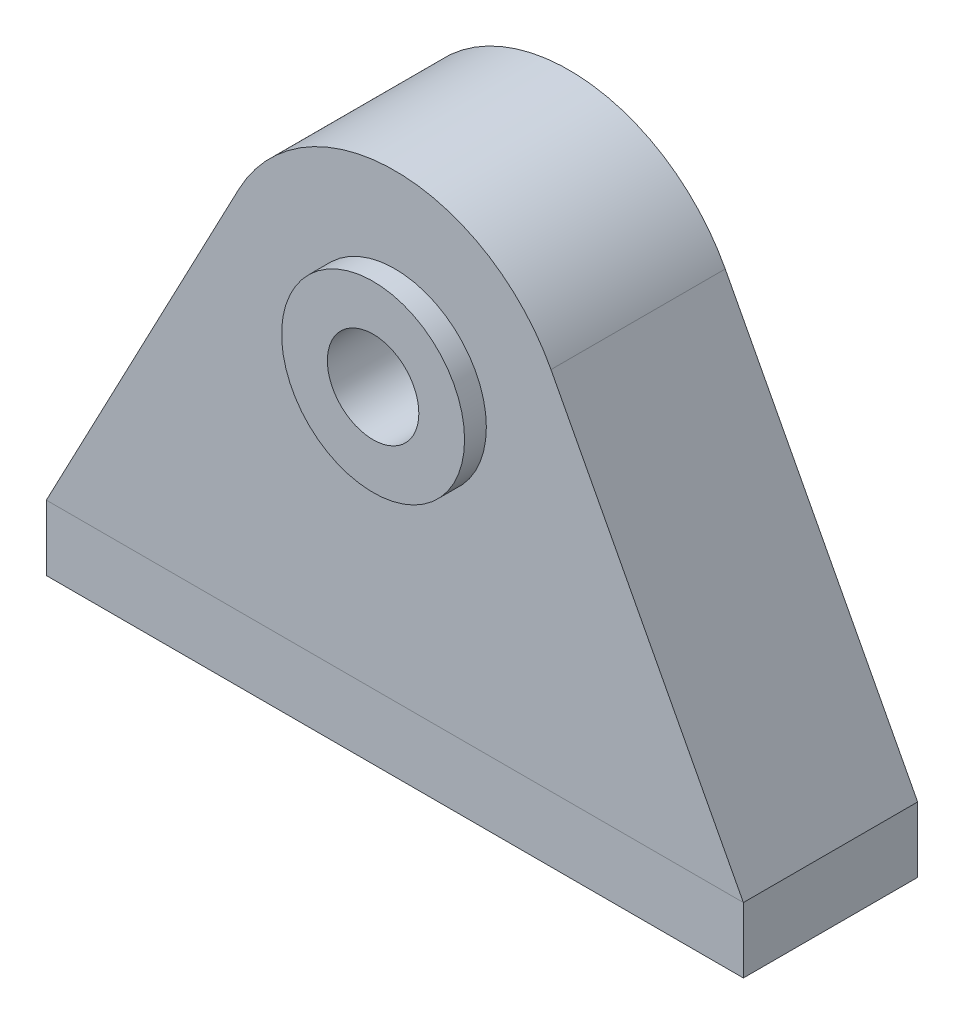
ISO-10303-21;
HEADER;
FILE_DESCRIPTION(('STEP AP214'),'2;1');
FILE_NAME('part.step','',(''),(''),'','','');
FILE_SCHEMA(('AUTOMOTIVE_DESIGN { 1 0 10303 214 1 1 1 1 }'));
ENDSEC;
DATA;
#1=APPLICATION_CONTEXT('core data for automotive mechanical design processes');
#2=APPLICATION_PROTOCOL_DEFINITION('international standard','automotive_design',2000,#1);
#3=PRODUCT_CONTEXT('',#1,'mechanical');
#4=PRODUCT('Part','Part','',(#3));
#5=PRODUCT_RELATED_PRODUCT_CATEGORY('part','',(#4));
#6=PRODUCT_DEFINITION_FORMATION('','',#4);
#7=PRODUCT_DEFINITION_CONTEXT('part definition',#1,'design');
#8=PRODUCT_DEFINITION('design','',#6,#7);
#9=PRODUCT_DEFINITION_SHAPE('','',#8);
#10=(LENGTH_UNIT() NAMED_UNIT(*) SI_UNIT(.MILLI.,.METRE.));
#11=(NAMED_UNIT(*) PLANE_ANGLE_UNIT() SI_UNIT($,.RADIAN.));
#12=(NAMED_UNIT(*) SI_UNIT($,.STERADIAN.) SOLID_ANGLE_UNIT());
#13=UNCERTAINTY_MEASURE_WITH_UNIT(LENGTH_MEASURE(1.E-05),#10,'distance_accuracy_value','');
#14=(GEOMETRIC_REPRESENTATION_CONTEXT(3) GLOBAL_UNCERTAINTY_ASSIGNED_CONTEXT((#13)) GLOBAL_UNIT_ASSIGNED_CONTEXT((#10,
#11,#12)) REPRESENTATION_CONTEXT('',''));
#15=CARTESIAN_POINT('',(0.,0.,0.));
#16=DIRECTION('',(0.,0.,1.));
#17=DIRECTION('',(1.,0.,0.));
#18=AXIS2_PLACEMENT_3D('',#15,#16,#17);
#19=CARTESIAN_POINT('',(0.,0.,-25.4));
#20=DIRECTION('',(0.,0.,1.));
#21=DIRECTION('',(1.,0.,0.));
#22=AXIS2_PLACEMENT_3D('',#19,#20,#21);
#23=PLANE('',#22);
#24=DIRECTION('',(-1.,0.,0.));
#25=VECTOR('',#24,1.);
#26=CARTESIAN_POINT('',(0.,19.05,-25.4));
#27=LINE('',#26,#25);
#28=CARTESIAN_POINT('',(101.6,19.05,-25.4));
#29=VERTEX_POINT('',#28);
#30=CARTESIAN_POINT('',(-101.6,19.05,-25.4));
#31=VERTEX_POINT('',#30);
#32=EDGE_CURVE('E54',#29,#31,#27,.T.);
#33=ORIENTED_EDGE('',*,*,#32,.F.);
#34=DIRECTION('',(0.,1.,0.));
#35=VECTOR('',#34,1.);
#36=CARTESIAN_POINT('',(101.6,0.,-25.4));
#37=LINE('',#36,#35);
#38=CARTESIAN_POINT('',(101.6,0.,-25.4));
#39=VERTEX_POINT('',#38);
#40=EDGE_CURVE('E146',#39,#29,#37,.T.);
#41=ORIENTED_EDGE('',*,*,#40,.F.);
#42=DIRECTION('',(1.,0.,0.));
#43=VECTOR('',#42,1.);
#44=CARTESIAN_POINT('',(0.,0.,-25.4));
#45=LINE('',#44,#43);
#46=CARTESIAN_POINT('',(-101.6,0.,-25.4));
#47=VERTEX_POINT('',#46);
#48=EDGE_CURVE('E85',#47,#39,#45,.T.);
#49=ORIENTED_EDGE('',*,*,#48,.F.);
#50=DIRECTION('',(0.,1.,0.));
#51=VECTOR('',#50,1.);
#52=CARTESIAN_POINT('',(-101.6,0.,-25.4));
#53=LINE('',#52,#51);
#54=EDGE_CURVE('E114',#47,#31,#53,.T.);
#55=ORIENTED_EDGE('',*,*,#54,.T.);
#56=EDGE_LOOP('',(#33,#41,#49,#55));
#57=FACE_BOUND('',#56,.T.);
#58=ADVANCED_FACE('F45',(#57),#23,.F.);
#59=CARTESIAN_POINT('',(0.,0.,25.4));
#60=DIRECTION('',(0.,0.,1.));
#61=DIRECTION('',(1.,0.,0.));
#62=AXIS2_PLACEMENT_3D('',#59,#60,#61);
#63=PLANE('',#62);
#64=DIRECTION('',(0.,1.,0.));
#65=VECTOR('',#64,1.);
#66=CARTESIAN_POINT('',(101.6,0.,25.4));
#67=LINE('',#66,#65);
#68=CARTESIAN_POINT('',(101.6,0.,25.4));
#69=VERTEX_POINT('',#68);
#70=CARTESIAN_POINT('',(101.6,19.05,25.4));
#71=VERTEX_POINT('',#70);
#72=EDGE_CURVE('E122',#69,#71,#67,.T.);
#73=ORIENTED_EDGE('',*,*,#72,.T.);
#74=DIRECTION('',(-1.,0.,0.));
#75=VECTOR('',#74,1.);
#76=CARTESIAN_POINT('',(0.,19.05,25.4));
#77=LINE('',#76,#75);
#78=CARTESIAN_POINT('',(-101.6,19.05,25.4));
#79=VERTEX_POINT('',#78);
#80=EDGE_CURVE('E62',#71,#79,#77,.T.);
#81=ORIENTED_EDGE('',*,*,#80,.T.);
#82=DIRECTION('',(0.,1.,0.));
#83=VECTOR('',#82,1.);
#84=CARTESIAN_POINT('',(-101.6,0.,25.4));
#85=LINE('',#84,#83);
#86=CARTESIAN_POINT('',(-101.6,0.,25.4));
#87=VERTEX_POINT('',#86);
#88=EDGE_CURVE('E113',#87,#79,#85,.T.);
#89=ORIENTED_EDGE('',*,*,#88,.F.);
#90=DIRECTION('',(1.,0.,0.));
#91=VECTOR('',#90,1.);
#92=CARTESIAN_POINT('',(0.,0.,25.4));
#93=LINE('',#92,#91);
#94=EDGE_CURVE('E118',#87,#69,#93,.T.);
#95=ORIENTED_EDGE('',*,*,#94,.T.);
#96=EDGE_LOOP('',(#73,#81,#89,#95));
#97=FACE_BOUND('',#96,.T.);
#98=ADVANCED_FACE('F124',(#97),#63,.T.);
#99=CARTESIAN_POINT('',(87.397011941816,46.0219086626603,25.4));
#100=DIRECTION('',(-0.884820223636944,-0.465932582937777,0.));
#101=DIRECTION('',(0.465932582937777,-0.884820223636944,0.));
#102=AXIS2_PLACEMENT_3D('',#99,#100,#101);
#103=PLANE('',#102);
#104=DIRECTION('',(-0.465932582937777,0.884820223636944,0.));
#105=VECTOR('',#104,1.);
#106=CARTESIAN_POINT('',(87.397011941816,46.0219086626603,-25.4));
#107=LINE('',#106,#105);
#108=CARTESIAN_POINT('',(45.5107282027662,125.565242403405,-25.4));
#109=VERTEX_POINT('',#108);
#110=EDGE_CURVE('E134',#29,#109,#107,.T.);
#111=ORIENTED_EDGE('',*,*,#110,.T.);
#112=DIRECTION('',(0.,0.,-1.));
#113=VECTOR('',#112,1.);
#114=CARTESIAN_POINT('',(45.5107282027662,125.565242403405,25.4));
#115=LINE('',#114,#113);
#116=CARTESIAN_POINT('',(45.5107282027662,125.565242403405,25.4));
#117=VERTEX_POINT('',#116);
#118=EDGE_CURVE('E155',#117,#109,#115,.T.);
#119=ORIENTED_EDGE('',*,*,#118,.F.);
#120=DIRECTION('',(-0.465932582937777,0.884820223636944,0.));
#121=VECTOR('',#120,1.);
#122=CARTESIAN_POINT('',(87.397011941816,46.0219086626603,25.4));
#123=LINE('',#122,#121);
#124=EDGE_CURVE('E148',#71,#117,#123,.T.);
#125=ORIENTED_EDGE('',*,*,#124,.F.);
#126=DIRECTION('',(0.,0.,-1.));
#127=VECTOR('',#126,1.);
#128=CARTESIAN_POINT('',(101.6,19.05,25.4));
#129=LINE('',#128,#127);
#130=EDGE_CURVE('E133',#71,#29,#129,.T.);
#131=ORIENTED_EDGE('',*,*,#130,.T.);
#132=EDGE_LOOP('',(#111,#119,#125,#131));
#133=FACE_BOUND('',#132,.T.);
#134=ADVANCED_FACE('F47',(#133),#103,.F.);
#135=CARTESIAN_POINT('',(0.,101.6,25.4));
#136=DIRECTION('',(0.,0.,-1.));
#137=DIRECTION('',(-1.,0.,0.));
#138=AXIS2_PLACEMENT_3D('',#135,#136,#137);
#139=CYLINDRICAL_SURFACE('',#138,51.435);
#140=CARTESIAN_POINT('',(0.,101.6,-25.4));
#141=DIRECTION('',(0.,0.,1.));
#142=DIRECTION('',(1.,0.,0.));
#143=AXIS2_PLACEMENT_3D('',#140,#141,#142);
#144=CIRCLE('',#143,51.435);
#145=CARTESIAN_POINT('',(-45.5107282027662,125.565242403405,-25.4));
#146=VERTEX_POINT('',#145);
#147=EDGE_CURVE('E136',#109,#146,#144,.T.);
#148=ORIENTED_EDGE('',*,*,#147,.T.);
#149=DIRECTION('',(0.,0.,-1.));
#150=VECTOR('',#149,1.);
#151=CARTESIAN_POINT('',(-45.5107282027662,125.565242403405,25.4));
#152=LINE('',#151,#150);
#153=CARTESIAN_POINT('',(-45.5107282027662,125.565242403405,25.4));
#154=VERTEX_POINT('',#153);
#155=EDGE_CURVE('E153',#154,#146,#152,.T.);
#156=ORIENTED_EDGE('',*,*,#155,.F.);
#157=CARTESIAN_POINT('',(0.,101.6,25.4));
#158=DIRECTION('',(0.,0.,1.));
#159=DIRECTION('',(1.,0.,0.));
#160=AXIS2_PLACEMENT_3D('',#157,#158,#159);
#161=CIRCLE('',#160,51.435);
#162=EDGE_CURVE('E100',#117,#154,#161,.T.);
#163=ORIENTED_EDGE('',*,*,#162,.F.);
#164=ORIENTED_EDGE('',*,*,#118,.T.);
#165=EDGE_LOOP('',(#148,#156,#163,#164));
#166=FACE_BOUND('',#165,.T.);
#167=ADVANCED_FACE('F240',(#166),#139,.T.);
#168=CARTESIAN_POINT('',(-87.397011941816,46.0219086626603,25.4));
#169=DIRECTION('',(-0.884820223636944,0.465932582937777,0.));
#170=DIRECTION('',(-0.465932582937777,-0.884820223636944,0.));
#171=AXIS2_PLACEMENT_3D('',#168,#169,#170);
#172=PLANE('',#171);
#173=DIRECTION('',(0.465932582937777,0.884820223636944,0.));
#174=VECTOR('',#173,1.);
#175=CARTESIAN_POINT('',(-87.397011941816,46.0219086626603,-25.4));
#176=LINE('',#175,#174);
#177=EDGE_CURVE('E141',#31,#146,#176,.T.);
#178=ORIENTED_EDGE('',*,*,#177,.F.);
#179=DIRECTION('',(0.,0.,-1.));
#180=VECTOR('',#179,1.);
#181=CARTESIAN_POINT('',(-101.6,19.05,25.4));
#182=LINE('',#181,#180);
#183=EDGE_CURVE('E115',#79,#31,#182,.T.);
#184=ORIENTED_EDGE('',*,*,#183,.F.);
#185=DIRECTION('',(0.465932582937777,0.884820223636944,0.));
#186=VECTOR('',#185,1.);
#187=CARTESIAN_POINT('',(-87.397011941816,46.0219086626603,25.4));
#188=LINE('',#187,#186);
#189=EDGE_CURVE('E126',#79,#154,#188,.T.);
#190=ORIENTED_EDGE('',*,*,#189,.T.);
#191=ORIENTED_EDGE('',*,*,#155,.T.);
#192=EDGE_LOOP('',(#178,#184,#190,#191));
#193=FACE_BOUND('',#192,.T.);
#194=ADVANCED_FACE('F166',(#193),#172,.T.);
#195=CARTESIAN_POINT('',(-101.6,0.,25.4));
#196=DIRECTION('',(-1.,0.,0.));
#197=DIRECTION('',(0.,0.,1.));
#198=AXIS2_PLACEMENT_3D('',#195,#196,#197);
#199=PLANE('',#198);
#200=ORIENTED_EDGE('',*,*,#54,.F.);
#201=DIRECTION('',(0.,0.,-1.));
#202=VECTOR('',#201,1.);
#203=CARTESIAN_POINT('',(-101.6,0.,25.4));
#204=LINE('',#203,#202);
#205=EDGE_CURVE('E108',#87,#47,#204,.T.);
#206=ORIENTED_EDGE('',*,*,#205,.F.);
#207=ORIENTED_EDGE('',*,*,#88,.T.);
#208=ORIENTED_EDGE('',*,*,#183,.T.);
#209=EDGE_LOOP('',(#200,#206,#207,#208));
#210=FACE_BOUND('',#209,.T.);
#211=ADVANCED_FACE('F110',(#210),#199,.T.);
#212=CARTESIAN_POINT('',(0.,0.,25.4));
#213=DIRECTION('',(0.,1.,0.));
#214=DIRECTION('',(0.,0.,1.));
#215=AXIS2_PLACEMENT_3D('',#212,#213,#214);
#216=PLANE('',#215);
#217=ORIENTED_EDGE('',*,*,#48,.T.);
#218=DIRECTION('',(0.,0.,-1.));
#219=VECTOR('',#218,1.);
#220=CARTESIAN_POINT('',(101.6,0.,25.4));
#221=LINE('',#220,#219);
#222=EDGE_CURVE('E116',#69,#39,#221,.T.);
#223=ORIENTED_EDGE('',*,*,#222,.F.);
#224=ORIENTED_EDGE('',*,*,#94,.F.);
#225=ORIENTED_EDGE('',*,*,#205,.T.);
#226=EDGE_LOOP('',(#217,#223,#224,#225));
#227=FACE_BOUND('',#226,.T.);
#228=ADVANCED_FACE('F119',(#227),#216,.F.);
#229=CARTESIAN_POINT('',(101.6,0.,25.4));
#230=DIRECTION('',(-1.,0.,0.));
#231=DIRECTION('',(0.,0.,1.));
#232=AXIS2_PLACEMENT_3D('',#229,#230,#231);
#233=PLANE('',#232);
#234=ORIENTED_EDGE('',*,*,#40,.T.);
#235=ORIENTED_EDGE('',*,*,#130,.F.);
#236=ORIENTED_EDGE('',*,*,#72,.F.);
#237=ORIENTED_EDGE('',*,*,#222,.T.);
#238=EDGE_LOOP('',(#234,#235,#236,#237));
#239=FACE_BOUND('',#238,.T.);
#240=ADVANCED_FACE('F169',(#239),#233,.F.);
#241=CARTESIAN_POINT('',(0.,101.6,25.4));
#242=DIRECTION('',(0.,0.,1.));
#243=DIRECTION('',(1.,0.,0.));
#244=AXIS2_PLACEMENT_3D('',#241,#242,#243);
#245=CIRCLE('',#244,26.67);
#246=CARTESIAN_POINT('',(26.67,101.6,25.4));
#247=VERTEX_POINT('',#246);
#248=EDGE_CURVE('E137',#247,#247,#245,.F.);
#249=ORIENTED_EDGE('',*,*,#248,.T.);
#250=EDGE_LOOP('',(#249));
#251=FACE_BOUND('',#250,.T.);
#252=ORIENTED_EDGE('',*,*,#80,.F.);
#253=ORIENTED_EDGE('',*,*,#124,.T.);
#254=ORIENTED_EDGE('',*,*,#162,.T.);
#255=ORIENTED_EDGE('',*,*,#189,.F.);
#256=EDGE_LOOP('',(#252,#253,#254,#255));
#257=FACE_BOUND('',#256,.T.);
#258=ADVANCED_FACE('F217',(#251,#257),#63,.T.);
#259=CARTESIAN_POINT('',(0.,101.6,-25.4));
#260=DIRECTION('',(0.,0.,1.));
#261=DIRECTION('',(1.,0.,0.));
#262=AXIS2_PLACEMENT_3D('',#259,#260,#261);
#263=CIRCLE('',#262,26.67);
#264=CARTESIAN_POINT('',(26.67,101.6,-25.4));
#265=VERTEX_POINT('',#264);
#266=EDGE_CURVE('E12',#265,#265,#263,.F.);
#267=ORIENTED_EDGE('',*,*,#266,.F.);
#268=EDGE_LOOP('',(#267));
#269=FACE_BOUND('',#268,.T.);
#270=ORIENTED_EDGE('',*,*,#110,.F.);
#271=ORIENTED_EDGE('',*,*,#32,.T.);
#272=ORIENTED_EDGE('',*,*,#177,.T.);
#273=ORIENTED_EDGE('',*,*,#147,.F.);
#274=EDGE_LOOP('',(#270,#271,#272,#273));
#275=FACE_BOUND('',#274,.T.);
#276=ADVANCED_FACE('F163',(#269,#275),#23,.F.);
#277=CARTESIAN_POINT('',(0.,101.6,-31.75));
#278=DIRECTION('',(0.,0.,1.));
#279=DIRECTION('',(1.,0.,0.));
#280=AXIS2_PLACEMENT_3D('',#277,#278,#279);
#281=PLANE('',#280);
#282=CARTESIAN_POINT('',(0.,101.6,-31.75));
#283=DIRECTION('',(0.,0.,1.));
#284=DIRECTION('',(1.,0.,0.));
#285=AXIS2_PLACEMENT_3D('',#282,#283,#284);
#286=CIRCLE('',#285,13.335);
#287=CARTESIAN_POINT('',(13.335,101.6,-31.75));
#288=VERTEX_POINT('',#287);
#289=EDGE_CURVE('E182',#288,#288,#286,.T.);
#290=ORIENTED_EDGE('',*,*,#289,.T.);
#291=EDGE_LOOP('',(#290));
#292=FACE_BOUND('',#291,.T.);
#293=CARTESIAN_POINT('',(0.,101.6,-31.75));
#294=DIRECTION('',(0.,0.,1.));
#295=DIRECTION('',(1.,0.,0.));
#296=AXIS2_PLACEMENT_3D('',#293,#294,#295);
#297=CIRCLE('',#296,26.67);
#298=CARTESIAN_POINT('',(26.67,101.6,-31.75));
#299=VERTEX_POINT('',#298);
#300=EDGE_CURVE('E179',#299,#299,#297,.T.);
#301=ORIENTED_EDGE('',*,*,#300,.F.);
#302=EDGE_LOOP('',(#301));
#303=FACE_BOUND('',#302,.T.);
#304=ADVANCED_FACE('F207',(#292,#303),#281,.F.);
#305=CARTESIAN_POINT('',(0.,101.6,31.75));
#306=DIRECTION('',(0.,0.,-1.));
#307=DIRECTION('',(-1.,0.,0.));
#308=AXIS2_PLACEMENT_3D('',#305,#306,#307);
#309=CYLINDRICAL_SURFACE('',#308,26.67);
#310=ORIENTED_EDGE('',*,*,#300,.T.);
#311=EDGE_LOOP('',(#310));
#312=FACE_BOUND('',#311,.T.);
#313=ORIENTED_EDGE('',*,*,#266,.T.);
#314=EDGE_LOOP('',(#313));
#315=FACE_BOUND('',#314,.T.);
#316=ADVANCED_FACE('F201',(#312,#315),#309,.T.);
#317=ORIENTED_EDGE('',*,*,#248,.F.);
#318=EDGE_LOOP('',(#317));
#319=FACE_BOUND('',#318,.T.);
#320=CARTESIAN_POINT('',(0.,101.6,31.75));
#321=DIRECTION('',(0.,0.,1.));
#322=DIRECTION('',(1.,0.,0.));
#323=AXIS2_PLACEMENT_3D('',#320,#321,#322);
#324=CIRCLE('',#323,26.67);
#325=CARTESIAN_POINT('',(26.67,101.6,31.75));
#326=VERTEX_POINT('',#325);
#327=EDGE_CURVE('E178',#326,#326,#324,.T.);
#328=ORIENTED_EDGE('',*,*,#327,.F.);
#329=EDGE_LOOP('',(#328));
#330=FACE_BOUND('',#329,.T.);
#331=ADVANCED_FACE('F196',(#319,#330),#309,.T.);
#332=CARTESIAN_POINT('',(0.,101.6,31.75));
#333=DIRECTION('',(0.,0.,1.));
#334=DIRECTION('',(1.,0.,0.));
#335=AXIS2_PLACEMENT_3D('',#332,#333,#334);
#336=PLANE('',#335);
#337=CARTESIAN_POINT('',(0.,101.6,31.75));
#338=DIRECTION('',(0.,0.,1.));
#339=DIRECTION('',(1.,0.,0.));
#340=AXIS2_PLACEMENT_3D('',#337,#338,#339);
#341=CIRCLE('',#340,13.335);
#342=CARTESIAN_POINT('',(13.335,101.6,31.75));
#343=VERTEX_POINT('',#342);
#344=EDGE_CURVE('E187',#343,#343,#341,.T.);
#345=ORIENTED_EDGE('',*,*,#344,.F.);
#346=EDGE_LOOP('',(#345));
#347=FACE_BOUND('',#346,.T.);
#348=ORIENTED_EDGE('',*,*,#327,.T.);
#349=EDGE_LOOP('',(#348));
#350=FACE_BOUND('',#349,.T.);
#351=ADVANCED_FACE('F193',(#347,#350),#336,.T.);
#352=CARTESIAN_POINT('',(0.,101.6,-31.75));
#353=DIRECTION('',(0.,0.,1.));
#354=DIRECTION('',(1.,0.,0.));
#355=AXIS2_PLACEMENT_3D('',#352,#353,#354);
#356=CYLINDRICAL_SURFACE('',#355,13.335);
#357=ORIENTED_EDGE('',*,*,#289,.F.);
#358=EDGE_LOOP('',(#357));
#359=FACE_BOUND('',#358,.T.);
#360=ORIENTED_EDGE('',*,*,#344,.T.);
#361=EDGE_LOOP('',(#360));
#362=FACE_BOUND('',#361,.T.);
#363=ADVANCED_FACE('F191',(#359,#362),#356,.F.);
#364=CLOSED_SHELL('',(#58,#98,#134,#167,#194,#211,#228,#240,#258,#276,#304,#316,#331,#351,#363));
#365=MANIFOLD_SOLID_BREP('B2',#364);
#366=ADVANCED_BREP_SHAPE_REPRESENTATION('',(#18,#365),#14);
#367=SHAPE_DEFINITION_REPRESENTATION(#9,#366);
ENDSEC;
END-ISO-10303-21;
